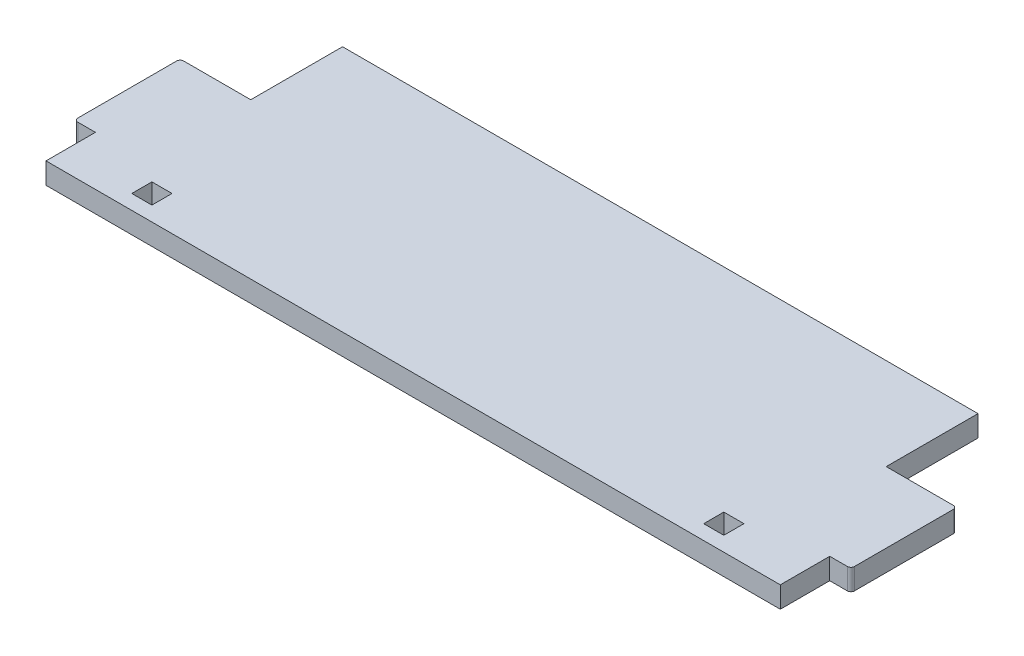
ISO-10303-21;
HEADER;
FILE_DESCRIPTION(('STEP AP214'),'2;1');
FILE_NAME('part.step','',(''),(''),'','','');
FILE_SCHEMA(('AUTOMOTIVE_DESIGN { 1 0 10303 214 1 1 1 1 }'));
ENDSEC;
DATA;
#1=APPLICATION_CONTEXT('core data for automotive mechanical design processes');
#2=APPLICATION_PROTOCOL_DEFINITION('international standard','automotive_design',2000,#1);
#3=PRODUCT_CONTEXT('',#1,'mechanical');
#4=PRODUCT('Part','Part','',(#3));
#5=PRODUCT_RELATED_PRODUCT_CATEGORY('part','',(#4));
#6=PRODUCT_DEFINITION_FORMATION('','',#4);
#7=PRODUCT_DEFINITION_CONTEXT('part definition',#1,'design');
#8=PRODUCT_DEFINITION('design','',#6,#7);
#9=PRODUCT_DEFINITION_SHAPE('','',#8);
#10=(LENGTH_UNIT() NAMED_UNIT(*) SI_UNIT(.MILLI.,.METRE.));
#11=(NAMED_UNIT(*) PLANE_ANGLE_UNIT() SI_UNIT($,.RADIAN.));
#12=(NAMED_UNIT(*) SI_UNIT($,.STERADIAN.) SOLID_ANGLE_UNIT());
#13=UNCERTAINTY_MEASURE_WITH_UNIT(LENGTH_MEASURE(1.E-05),#10,'distance_accuracy_value','');
#14=(GEOMETRIC_REPRESENTATION_CONTEXT(3) GLOBAL_UNCERTAINTY_ASSIGNED_CONTEXT((#13)) GLOBAL_UNIT_ASSIGNED_CONTEXT((#10,
#11,#12)) REPRESENTATION_CONTEXT('',''));
#15=CARTESIAN_POINT('',(0.,0.,0.));
#16=DIRECTION('',(0.,0.,1.));
#17=DIRECTION('',(1.,0.,0.));
#18=AXIS2_PLACEMENT_3D('',#15,#16,#17);
#19=CARTESIAN_POINT('',(0.,3.,-4.925));
#20=DIRECTION('',(0.,0.,-1.));
#21=DIRECTION('',(-1.,0.,0.));
#22=AXIS2_PLACEMENT_3D('',#19,#20,#21);
#23=PLANE('',#22);
#24=DIRECTION('',(1.,0.,0.));
#25=VECTOR('',#24,1.);
#26=CARTESIAN_POINT('',(0.,0.,-4.925));
#27=LINE('',#26,#25);
#28=CARTESIAN_POINT('',(39.075,0.,-4.925));
#29=VERTEX_POINT('',#28);
#30=CARTESIAN_POINT('',(41.925,0.,-4.925));
#31=VERTEX_POINT('',#30);
#32=EDGE_CURVE('E321',#29,#31,#27,.T.);
#33=ORIENTED_EDGE('',*,*,#32,.T.);
#34=DIRECTION('',(0.,-1.,0.));
#35=VECTOR('',#34,1.);
#36=CARTESIAN_POINT('',(41.925,3.,-4.925));
#37=LINE('',#36,#35);
#38=CARTESIAN_POINT('',(41.925,3.,-4.925));
#39=VERTEX_POINT('',#38);
#40=EDGE_CURVE('E336',#39,#31,#37,.T.);
#41=ORIENTED_EDGE('',*,*,#40,.F.);
#42=DIRECTION('',(1.,0.,0.));
#43=VECTOR('',#42,1.);
#44=CARTESIAN_POINT('',(0.,3.,-4.925));
#45=LINE('',#44,#43);
#46=CARTESIAN_POINT('',(39.075,3.,-4.925));
#47=VERTEX_POINT('',#46);
#48=EDGE_CURVE('E266',#47,#39,#45,.T.);
#49=ORIENTED_EDGE('',*,*,#48,.F.);
#50=DIRECTION('',(0.,-1.,0.));
#51=VECTOR('',#50,1.);
#52=CARTESIAN_POINT('',(39.075,3.,-4.925));
#53=LINE('',#52,#51);
#54=EDGE_CURVE('E329',#47,#29,#53,.T.);
#55=ORIENTED_EDGE('',*,*,#54,.T.);
#56=EDGE_LOOP('',(#33,#41,#49,#55));
#57=FACE_BOUND('',#56,.T.);
#58=ADVANCED_FACE('F40',(#57),#23,.F.);
#59=CARTESIAN_POINT('',(41.925,3.,0.));
#60=DIRECTION('',(1.,0.,0.));
#61=DIRECTION('',(0.,0.,-1.));
#62=AXIS2_PLACEMENT_3D('',#59,#60,#61);
#63=PLANE('',#62);
#64=DIRECTION('',(0.,0.,1.));
#65=VECTOR('',#64,1.);
#66=CARTESIAN_POINT('',(41.925,0.,0.));
#67=LINE('',#66,#65);
#68=CARTESIAN_POINT('',(41.925,0.,-2.075));
#69=VERTEX_POINT('',#68);
#70=EDGE_CURVE('E324',#31,#69,#67,.T.);
#71=ORIENTED_EDGE('',*,*,#70,.T.);
#72=DIRECTION('',(0.,-1.,0.));
#73=VECTOR('',#72,1.);
#74=CARTESIAN_POINT('',(41.925,3.,-2.075));
#75=LINE('',#74,#73);
#76=CARTESIAN_POINT('',(41.925,3.,-2.075));
#77=VERTEX_POINT('',#76);
#78=EDGE_CURVE('E334',#77,#69,#75,.T.);
#79=ORIENTED_EDGE('',*,*,#78,.F.);
#80=DIRECTION('',(0.,0.,1.));
#81=VECTOR('',#80,1.);
#82=CARTESIAN_POINT('',(41.925,3.,0.));
#83=LINE('',#82,#81);
#84=EDGE_CURVE('E269',#39,#77,#83,.T.);
#85=ORIENTED_EDGE('',*,*,#84,.F.);
#86=ORIENTED_EDGE('',*,*,#40,.T.);
#87=EDGE_LOOP('',(#71,#79,#85,#86));
#88=FACE_BOUND('',#87,.T.);
#89=ADVANCED_FACE('F464',(#88),#63,.F.);
#90=CARTESIAN_POINT('',(0.,3.,-2.075));
#91=DIRECTION('',(0.,0.,-1.));
#92=DIRECTION('',(-1.,0.,0.));
#93=AXIS2_PLACEMENT_3D('',#90,#91,#92);
#94=PLANE('',#93);
#95=DIRECTION('',(1.,0.,0.));
#96=VECTOR('',#95,1.);
#97=CARTESIAN_POINT('',(0.,0.,-2.075));
#98=LINE('',#97,#96);
#99=CARTESIAN_POINT('',(39.075,0.,-2.075));
#100=VERTEX_POINT('',#99);
#101=EDGE_CURVE('E230',#100,#69,#98,.T.);
#102=ORIENTED_EDGE('',*,*,#101,.F.);
#103=DIRECTION('',(0.,-1.,0.));
#104=VECTOR('',#103,1.);
#105=CARTESIAN_POINT('',(39.075,3.,-2.075));
#106=LINE('',#105,#104);
#107=CARTESIAN_POINT('',(39.075,3.,-2.075));
#108=VERTEX_POINT('',#107);
#109=EDGE_CURVE('E331',#108,#100,#106,.T.);
#110=ORIENTED_EDGE('',*,*,#109,.F.);
#111=DIRECTION('',(1.,0.,0.));
#112=VECTOR('',#111,1.);
#113=CARTESIAN_POINT('',(0.,3.,-2.075));
#114=LINE('',#113,#112);
#115=EDGE_CURVE('E271',#108,#77,#114,.T.);
#116=ORIENTED_EDGE('',*,*,#115,.T.);
#117=ORIENTED_EDGE('',*,*,#78,.T.);
#118=EDGE_LOOP('',(#102,#110,#116,#117));
#119=FACE_BOUND('',#118,.T.);
#120=ADVANCED_FACE('F470',(#119),#94,.T.);
#121=CARTESIAN_POINT('',(-52.,3.,0.));
#122=DIRECTION('',(-1.,0.,0.));
#123=DIRECTION('',(0.,0.,1.));
#124=AXIS2_PLACEMENT_3D('',#121,#122,#123);
#125=PLANE('',#124);
#126=DIRECTION('',(0.,0.,-1.));
#127=VECTOR('',#126,1.);
#128=CARTESIAN_POINT('',(-52.,0.,0.));
#129=LINE('',#128,#127);
#130=CARTESIAN_POINT('',(-52.,0.,0.));
#131=VERTEX_POINT('',#130);
#132=CARTESIAN_POINT('',(-52.,0.,-7.));
#133=VERTEX_POINT('',#132);
#134=EDGE_CURVE('E287',#131,#133,#129,.T.);
#135=ORIENTED_EDGE('',*,*,#134,.F.);
#136=DIRECTION('',(0.,-1.,0.));
#137=VECTOR('',#136,1.);
#138=CARTESIAN_POINT('',(-52.,3.,0.));
#139=LINE('',#138,#137);
#140=CARTESIAN_POINT('',(-52.,3.,0.));
#141=VERTEX_POINT('',#140);
#142=EDGE_CURVE('E332',#141,#131,#139,.T.);
#143=ORIENTED_EDGE('',*,*,#142,.F.);
#144=DIRECTION('',(0.,0.,-1.));
#145=VECTOR('',#144,1.);
#146=CARTESIAN_POINT('',(-52.,3.,0.));
#147=LINE('',#146,#145);
#148=CARTESIAN_POINT('',(-52.,3.,-7.));
#149=VERTEX_POINT('',#148);
#150=EDGE_CURVE('E235',#141,#149,#147,.T.);
#151=ORIENTED_EDGE('',*,*,#150,.T.);
#152=DIRECTION('',(0.,-1.,0.));
#153=VECTOR('',#152,1.);
#154=CARTESIAN_POINT('',(-52.,3.,-7.));
#155=LINE('',#154,#153);
#156=EDGE_CURVE('E213',#149,#133,#155,.T.);
#157=ORIENTED_EDGE('',*,*,#156,.T.);
#158=EDGE_LOOP('',(#135,#143,#151,#157));
#159=FACE_BOUND('',#158,.T.);
#160=ADVANCED_FACE('F418',(#159),#125,.T.);
#161=CARTESIAN_POINT('',(0.,3.,0.));
#162=DIRECTION('',(0.,0.,-1.));
#163=DIRECTION('',(-1.,0.,0.));
#164=AXIS2_PLACEMENT_3D('',#161,#162,#163);
#165=PLANE('',#164);
#166=DIRECTION('',(1.,0.,0.));
#167=VECTOR('',#166,1.);
#168=CARTESIAN_POINT('',(0.,0.,0.));
#169=LINE('',#168,#167);
#170=CARTESIAN_POINT('',(52.,0.,0.));
#171=VERTEX_POINT('',#170);
#172=EDGE_CURVE('E290',#131,#171,#169,.T.);
#173=ORIENTED_EDGE('',*,*,#172,.T.);
#174=DIRECTION('',(0.,-1.,0.));
#175=VECTOR('',#174,1.);
#176=CARTESIAN_POINT('',(52.,3.,0.));
#177=LINE('',#176,#175);
#178=CARTESIAN_POINT('',(52.,3.,0.));
#179=VERTEX_POINT('',#178);
#180=EDGE_CURVE('E355',#179,#171,#177,.T.);
#181=ORIENTED_EDGE('',*,*,#180,.F.);
#182=DIRECTION('',(1.,0.,0.));
#183=VECTOR('',#182,1.);
#184=CARTESIAN_POINT('',(0.,3.,0.));
#185=LINE('',#184,#183);
#186=EDGE_CURVE('E238',#141,#179,#185,.T.);
#187=ORIENTED_EDGE('',*,*,#186,.F.);
#188=ORIENTED_EDGE('',*,*,#142,.T.);
#189=EDGE_LOOP('',(#173,#181,#187,#188));
#190=FACE_BOUND('',#189,.T.);
#191=ADVANCED_FACE('F421',(#190),#165,.F.);
#192=CARTESIAN_POINT('',(52.,3.,0.));
#193=DIRECTION('',(-1.,0.,0.));
#194=DIRECTION('',(0.,0.,1.));
#195=AXIS2_PLACEMENT_3D('',#192,#193,#194);
#196=PLANE('',#195);
#197=DIRECTION('',(0.,0.,-1.));
#198=VECTOR('',#197,1.);
#199=CARTESIAN_POINT('',(52.,0.,0.));
#200=LINE('',#199,#198);
#201=CARTESIAN_POINT('',(52.,0.,-7.));
#202=VERTEX_POINT('',#201);
#203=EDGE_CURVE('E293',#171,#202,#200,.T.);
#204=ORIENTED_EDGE('',*,*,#203,.T.);
#205=DIRECTION('',(0.,-1.,0.));
#206=VECTOR('',#205,1.);
#207=CARTESIAN_POINT('',(52.,3.,-7.));
#208=LINE('',#207,#206);
#209=CARTESIAN_POINT('',(52.,3.,-7.));
#210=VERTEX_POINT('',#209);
#211=EDGE_CURVE('E352',#210,#202,#208,.T.);
#212=ORIENTED_EDGE('',*,*,#211,.F.);
#213=DIRECTION('',(0.,0.,-1.));
#214=VECTOR('',#213,1.);
#215=CARTESIAN_POINT('',(52.,3.,0.));
#216=LINE('',#215,#214);
#217=EDGE_CURVE('E241',#179,#210,#216,.T.);
#218=ORIENTED_EDGE('',*,*,#217,.F.);
#219=ORIENTED_EDGE('',*,*,#180,.T.);
#220=EDGE_LOOP('',(#204,#212,#218,#219));
#221=FACE_BOUND('',#220,.T.);
#222=ADVANCED_FACE('F423',(#221),#196,.F.);
#223=CARTESIAN_POINT('',(0.,3.,-7.00000000000002));
#224=DIRECTION('',(0.,0.,-1.));
#225=DIRECTION('',(-1.,0.,0.));
#226=AXIS2_PLACEMENT_3D('',#223,#224,#225);
#227=PLANE('',#226);
#228=DIRECTION('',(1.,0.,0.));
#229=VECTOR('',#228,1.);
#230=CARTESIAN_POINT('',(0.,0.,-7.00000000000002));
#231=LINE('',#230,#229);
#232=CARTESIAN_POINT('',(54.5,0.,-7.));
#233=VERTEX_POINT('',#232);
#234=EDGE_CURVE('E296',#202,#233,#231,.T.);
#235=ORIENTED_EDGE('',*,*,#234,.T.);
#236=DIRECTION('',(0.,-1.,0.));
#237=VECTOR('',#236,1.);
#238=CARTESIAN_POINT('',(54.5,3.,-7.));
#239=LINE('',#238,#237);
#240=CARTESIAN_POINT('',(54.5,3.,-7.));
#241=VERTEX_POINT('',#240);
#242=EDGE_CURVE('E384',#233,#241,#239,.F.);
#243=ORIENTED_EDGE('',*,*,#242,.T.);
#244=DIRECTION('',(1.,0.,0.));
#245=VECTOR('',#244,1.);
#246=CARTESIAN_POINT('',(0.,3.,-7.00000000000002));
#247=LINE('',#246,#245);
#248=EDGE_CURVE('E244',#210,#241,#247,.T.);
#249=ORIENTED_EDGE('',*,*,#248,.F.);
#250=ORIENTED_EDGE('',*,*,#211,.T.);
#251=EDGE_LOOP('',(#235,#243,#249,#250));
#252=FACE_BOUND('',#251,.T.);
#253=ADVANCED_FACE('F576',(#252),#227,.F.);
#254=CARTESIAN_POINT('',(55.,3.,0.));
#255=DIRECTION('',(-1.,0.,0.));
#256=DIRECTION('',(0.,0.,1.));
#257=AXIS2_PLACEMENT_3D('',#254,#255,#256);
#258=PLANE('',#257);
#259=DIRECTION('',(0.,0.,-1.));
#260=VECTOR('',#259,1.);
#261=CARTESIAN_POINT('',(55.,0.,0.));
#262=LINE('',#261,#260);
#263=CARTESIAN_POINT('',(55.,0.,-7.5));
#264=VERTEX_POINT('',#263);
#265=CARTESIAN_POINT('',(55.,0.,-21.5));
#266=VERTEX_POINT('',#265);
#267=EDGE_CURVE('E299',#264,#266,#262,.T.);
#268=ORIENTED_EDGE('',*,*,#267,.T.);
#269=DIRECTION('',(0.,-1.,0.));
#270=VECTOR('',#269,1.);
#271=CARTESIAN_POINT('',(55.,3.,-21.5));
#272=LINE('',#271,#270);
#273=CARTESIAN_POINT('',(55.,3.,-21.5));
#274=VERTEX_POINT('',#273);
#275=EDGE_CURVE('E376',#266,#274,#272,.F.);
#276=ORIENTED_EDGE('',*,*,#275,.T.);
#277=DIRECTION('',(0.,0.,-1.));
#278=VECTOR('',#277,1.);
#279=CARTESIAN_POINT('',(55.,3.,0.));
#280=LINE('',#279,#278);
#281=CARTESIAN_POINT('',(55.,3.,-7.5));
#282=VERTEX_POINT('',#281);
#283=EDGE_CURVE('E247',#282,#274,#280,.T.);
#284=ORIENTED_EDGE('',*,*,#283,.F.);
#285=DIRECTION('',(0.,-1.,0.));
#286=VECTOR('',#285,1.);
#287=CARTESIAN_POINT('',(55.,3.,-7.5));
#288=LINE('',#287,#286);
#289=EDGE_CURVE('E373',#282,#264,#288,.T.);
#290=ORIENTED_EDGE('',*,*,#289,.T.);
#291=EDGE_LOOP('',(#268,#276,#284,#290));
#292=FACE_BOUND('',#291,.T.);
#293=ADVANCED_FACE('F434',(#292),#258,.F.);
#294=CARTESIAN_POINT('',(0.,3.,-22.));
#295=DIRECTION('',(0.,0.,1.));
#296=DIRECTION('',(1.,0.,0.));
#297=AXIS2_PLACEMENT_3D('',#294,#295,#296);
#298=PLANE('',#297);
#299=DIRECTION('',(-1.,0.,0.));
#300=VECTOR('',#299,1.);
#301=CARTESIAN_POINT('',(0.,3.,-22.));
#302=LINE('',#301,#300);
#303=CARTESIAN_POINT('',(54.5,3.,-22.));
#304=VERTEX_POINT('',#303);
#305=CARTESIAN_POINT('',(45.,3.,-22.));
#306=VERTEX_POINT('',#305);
#307=EDGE_CURVE('E250',#304,#306,#302,.T.);
#308=ORIENTED_EDGE('',*,*,#307,.F.);
#309=DIRECTION('',(0.,-1.,0.));
#310=VECTOR('',#309,1.);
#311=CARTESIAN_POINT('',(54.5,3.,-22.));
#312=LINE('',#311,#310);
#313=CARTESIAN_POINT('',(54.5,0.,-22.));
#314=VERTEX_POINT('',#313);
#315=EDGE_CURVE('E339',#304,#314,#312,.T.);
#316=ORIENTED_EDGE('',*,*,#315,.T.);
#317=DIRECTION('',(-1.,0.,0.));
#318=VECTOR('',#317,1.);
#319=CARTESIAN_POINT('',(0.,0.,-22.));
#320=LINE('',#319,#318);
#321=CARTESIAN_POINT('',(45.,0.,-22.));
#322=VERTEX_POINT('',#321);
#323=EDGE_CURVE('E302',#314,#322,#320,.T.);
#324=ORIENTED_EDGE('',*,*,#323,.T.);
#325=DIRECTION('',(0.,-1.,0.));
#326=VECTOR('',#325,1.);
#327=CARTESIAN_POINT('',(45.,3.,-22.));
#328=LINE('',#327,#326);
#329=EDGE_CURVE('E349',#306,#322,#328,.T.);
#330=ORIENTED_EDGE('',*,*,#329,.F.);
#331=EDGE_LOOP('',(#308,#316,#324,#330));
#332=FACE_BOUND('',#331,.T.);
#333=ADVANCED_FACE('F443',(#332),#298,.F.);
#334=CARTESIAN_POINT('',(45.,3.,0.));
#335=DIRECTION('',(-1.,0.,0.));
#336=DIRECTION('',(0.,0.,1.));
#337=AXIS2_PLACEMENT_3D('',#334,#335,#336);
#338=PLANE('',#337);
#339=DIRECTION('',(0.,0.,-1.));
#340=VECTOR('',#339,1.);
#341=CARTESIAN_POINT('',(45.,0.,0.));
#342=LINE('',#341,#340);
#343=CARTESIAN_POINT('',(45.,0.,-35.));
#344=VERTEX_POINT('',#343);
#345=EDGE_CURVE('E304',#322,#344,#342,.T.);
#346=ORIENTED_EDGE('',*,*,#345,.T.);
#347=DIRECTION('',(0.,-1.,0.));
#348=VECTOR('',#347,1.);
#349=CARTESIAN_POINT('',(45.,3.,-35.));
#350=LINE('',#349,#348);
#351=CARTESIAN_POINT('',(45.,3.,-35.));
#352=VERTEX_POINT('',#351);
#353=EDGE_CURVE('E346',#352,#344,#350,.T.);
#354=ORIENTED_EDGE('',*,*,#353,.F.);
#355=DIRECTION('',(0.,0.,-1.));
#356=VECTOR('',#355,1.);
#357=CARTESIAN_POINT('',(45.,3.,0.));
#358=LINE('',#357,#356);
#359=EDGE_CURVE('E252',#306,#352,#358,.T.);
#360=ORIENTED_EDGE('',*,*,#359,.F.);
#361=ORIENTED_EDGE('',*,*,#329,.T.);
#362=EDGE_LOOP('',(#346,#354,#360,#361));
#363=FACE_BOUND('',#362,.T.);
#364=ADVANCED_FACE('F448',(#363),#338,.F.);
#365=CARTESIAN_POINT('',(0.,3.,-35.));
#366=DIRECTION('',(0.,0.,1.));
#367=DIRECTION('',(1.,0.,0.));
#368=AXIS2_PLACEMENT_3D('',#365,#366,#367);
#369=PLANE('',#368);
#370=DIRECTION('',(-1.,0.,0.));
#371=VECTOR('',#370,1.);
#372=CARTESIAN_POINT('',(0.,0.,-35.));
#373=LINE('',#372,#371);
#374=CARTESIAN_POINT('',(-45.,0.,-35.));
#375=VERTEX_POINT('',#374);
#376=EDGE_CURVE('E307',#344,#375,#373,.T.);
#377=ORIENTED_EDGE('',*,*,#376,.T.);
#378=DIRECTION('',(0.,-1.,0.));
#379=VECTOR('',#378,1.);
#380=CARTESIAN_POINT('',(-45.,3.,-35.));
#381=LINE('',#380,#379);
#382=CARTESIAN_POINT('',(-45.,3.,-35.));
#383=VERTEX_POINT('',#382);
#384=EDGE_CURVE('E344',#383,#375,#381,.T.);
#385=ORIENTED_EDGE('',*,*,#384,.F.);
#386=DIRECTION('',(-1.,0.,0.));
#387=VECTOR('',#386,1.);
#388=CARTESIAN_POINT('',(0.,3.,-35.));
#389=LINE('',#388,#387);
#390=EDGE_CURVE('E255',#352,#383,#389,.T.);
#391=ORIENTED_EDGE('',*,*,#390,.F.);
#392=ORIENTED_EDGE('',*,*,#353,.T.);
#393=EDGE_LOOP('',(#377,#385,#391,#392));
#394=FACE_BOUND('',#393,.T.);
#395=ADVANCED_FACE('F450',(#394),#369,.F.);
#396=CARTESIAN_POINT('',(-45.,3.,0.));
#397=DIRECTION('',(-1.,0.,0.));
#398=DIRECTION('',(0.,0.,1.));
#399=AXIS2_PLACEMENT_3D('',#396,#397,#398);
#400=PLANE('',#399);
#401=DIRECTION('',(0.,0.,-1.));
#402=VECTOR('',#401,1.);
#403=CARTESIAN_POINT('',(-45.,0.,0.));
#404=LINE('',#403,#402);
#405=CARTESIAN_POINT('',(-45.,0.,-22.));
#406=VERTEX_POINT('',#405);
#407=EDGE_CURVE('E310',#406,#375,#404,.T.);
#408=ORIENTED_EDGE('',*,*,#407,.F.);
#409=DIRECTION('',(0.,-1.,0.));
#410=VECTOR('',#409,1.);
#411=CARTESIAN_POINT('',(-45.,3.,-22.));
#412=LINE('',#411,#410);
#413=CARTESIAN_POINT('',(-45.,3.,-22.));
#414=VERTEX_POINT('',#413);
#415=EDGE_CURVE('E341',#414,#406,#412,.T.);
#416=ORIENTED_EDGE('',*,*,#415,.F.);
#417=DIRECTION('',(0.,0.,-1.));
#418=VECTOR('',#417,1.);
#419=CARTESIAN_POINT('',(-45.,3.,0.));
#420=LINE('',#419,#418);
#421=EDGE_CURVE('E257',#414,#383,#420,.T.);
#422=ORIENTED_EDGE('',*,*,#421,.T.);
#423=ORIENTED_EDGE('',*,*,#384,.T.);
#424=EDGE_LOOP('',(#408,#416,#422,#423));
#425=FACE_BOUND('',#424,.T.);
#426=ADVANCED_FACE('F454',(#425),#400,.T.);
#427=CARTESIAN_POINT('',(0.,3.,-22.));
#428=DIRECTION('',(0.,0.,-1.));
#429=DIRECTION('',(-1.,0.,0.));
#430=AXIS2_PLACEMENT_3D('',#427,#428,#429);
#431=PLANE('',#430);
#432=DIRECTION('',(1.,0.,0.));
#433=VECTOR('',#432,1.);
#434=CARTESIAN_POINT('',(0.,0.,-22.));
#435=LINE('',#434,#433);
#436=CARTESIAN_POINT('',(-54.5,0.,-22.));
#437=VERTEX_POINT('',#436);
#438=EDGE_CURVE('E313',#437,#406,#435,.T.);
#439=ORIENTED_EDGE('',*,*,#438,.F.);
#440=DIRECTION('',(0.,-1.,0.));
#441=VECTOR('',#440,1.);
#442=CARTESIAN_POINT('',(-54.5,3.,-22.));
#443=LINE('',#442,#441);
#444=CARTESIAN_POINT('',(-54.5,3.,-22.));
#445=VERTEX_POINT('',#444);
#446=EDGE_CURVE('E48',#437,#445,#443,.F.);
#447=ORIENTED_EDGE('',*,*,#446,.T.);
#448=DIRECTION('',(1.,0.,0.));
#449=VECTOR('',#448,1.);
#450=CARTESIAN_POINT('',(0.,3.,-22.));
#451=LINE('',#450,#449);
#452=EDGE_CURVE('E260',#445,#414,#451,.T.);
#453=ORIENTED_EDGE('',*,*,#452,.T.);
#454=ORIENTED_EDGE('',*,*,#415,.T.);
#455=EDGE_LOOP('',(#439,#447,#453,#454));
#456=FACE_BOUND('',#455,.T.);
#457=ADVANCED_FACE('F393',(#456),#431,.T.);
#458=CARTESIAN_POINT('',(-55.,3.,0.));
#459=DIRECTION('',(-1.,0.,0.));
#460=DIRECTION('',(0.,0.,1.));
#461=AXIS2_PLACEMENT_3D('',#458,#459,#460);
#462=PLANE('',#461);
#463=DIRECTION('',(0.,0.,-1.));
#464=VECTOR('',#463,1.);
#465=CARTESIAN_POINT('',(-55.,3.,0.));
#466=LINE('',#465,#464);
#467=CARTESIAN_POINT('',(-55.,3.,-7.5));
#468=VERTEX_POINT('',#467);
#469=CARTESIAN_POINT('',(-55.,3.,-21.5));
#470=VERTEX_POINT('',#469);
#471=EDGE_CURVE('E262',#468,#470,#466,.T.);
#472=ORIENTED_EDGE('',*,*,#471,.T.);
#473=DIRECTION('',(0.,-1.,0.));
#474=VECTOR('',#473,1.);
#475=CARTESIAN_POINT('',(-55.,3.,-21.5));
#476=LINE('',#475,#474);
#477=CARTESIAN_POINT('',(-55.,0.,-21.5));
#478=VERTEX_POINT('',#477);
#479=EDGE_CURVE('E388',#470,#478,#476,.T.);
#480=ORIENTED_EDGE('',*,*,#479,.T.);
#481=DIRECTION('',(0.,0.,-1.));
#482=VECTOR('',#481,1.);
#483=CARTESIAN_POINT('',(-55.,0.,0.));
#484=LINE('',#483,#482);
#485=CARTESIAN_POINT('',(-55.,0.,-7.5));
#486=VERTEX_POINT('',#485);
#487=EDGE_CURVE('E315',#486,#478,#484,.T.);
#488=ORIENTED_EDGE('',*,*,#487,.F.);
#489=DIRECTION('',(0.,-1.,0.));
#490=VECTOR('',#489,1.);
#491=CARTESIAN_POINT('',(-55.,3.,-7.5));
#492=LINE('',#491,#490);
#493=EDGE_CURVE('E386',#486,#468,#492,.F.);
#494=ORIENTED_EDGE('',*,*,#493,.T.);
#495=EDGE_LOOP('',(#472,#480,#488,#494));
#496=FACE_BOUND('',#495,.T.);
#497=ADVANCED_FACE('F402',(#496),#462,.T.);
#498=CARTESIAN_POINT('',(0.,3.,-4.925));
#499=DIRECTION('',(0.,0.,1.));
#500=DIRECTION('',(1.,0.,0.));
#501=AXIS2_PLACEMENT_3D('',#498,#499,#500);
#502=PLANE('',#501);
#503=DIRECTION('',(-1.,0.,0.));
#504=VECTOR('',#503,1.);
#505=CARTESIAN_POINT('',(0.,0.,-4.925));
#506=LINE('',#505,#504);
#507=CARTESIAN_POINT('',(-39.075,0.,-4.925));
#508=VERTEX_POINT('',#507);
#509=CARTESIAN_POINT('',(-41.925,0.,-4.925));
#510=VERTEX_POINT('',#509);
#511=EDGE_CURVE('E210',#508,#510,#506,.T.);
#512=ORIENTED_EDGE('',*,*,#511,.F.);
#513=DIRECTION('',(0.,-1.,0.));
#514=VECTOR('',#513,1.);
#515=CARTESIAN_POINT('',(-39.075,3.,-4.925));
#516=LINE('',#515,#514);
#517=CARTESIAN_POINT('',(-39.075,3.,-4.925));
#518=VERTEX_POINT('',#517);
#519=EDGE_CURVE('E203',#518,#508,#516,.T.);
#520=ORIENTED_EDGE('',*,*,#519,.F.);
#521=DIRECTION('',(-1.,0.,0.));
#522=VECTOR('',#521,1.);
#523=CARTESIAN_POINT('',(0.,3.,-4.925));
#524=LINE('',#523,#522);
#525=CARTESIAN_POINT('',(-41.925,3.,-4.925));
#526=VERTEX_POINT('',#525);
#527=EDGE_CURVE('E207',#518,#526,#524,.T.);
#528=ORIENTED_EDGE('',*,*,#527,.T.);
#529=DIRECTION('',(0.,-1.,0.));
#530=VECTOR('',#529,1.);
#531=CARTESIAN_POINT('',(-41.925,3.,-4.925));
#532=LINE('',#531,#530);
#533=EDGE_CURVE('E277',#526,#510,#532,.T.);
#534=ORIENTED_EDGE('',*,*,#533,.T.);
#535=EDGE_LOOP('',(#512,#520,#528,#534));
#536=FACE_BOUND('',#535,.T.);
#537=ADVANCED_FACE('F205',(#536),#502,.T.);
#538=CARTESIAN_POINT('',(-39.075,3.,0.));
#539=DIRECTION('',(1.,0.,0.));
#540=DIRECTION('',(0.,0.,-1.));
#541=AXIS2_PLACEMENT_3D('',#538,#539,#540);
#542=PLANE('',#541);
#543=DIRECTION('',(0.,0.,1.));
#544=VECTOR('',#543,1.);
#545=CARTESIAN_POINT('',(-39.075,0.,0.));
#546=LINE('',#545,#544);
#547=CARTESIAN_POINT('',(-39.075,0.,-2.075));
#548=VERTEX_POINT('',#547);
#549=EDGE_CURVE('E279',#508,#548,#546,.T.);
#550=ORIENTED_EDGE('',*,*,#549,.T.);
#551=DIRECTION('',(0.,-1.,0.));
#552=VECTOR('',#551,1.);
#553=CARTESIAN_POINT('',(-39.075,3.,-2.075));
#554=LINE('',#553,#552);
#555=CARTESIAN_POINT('',(-39.075,3.,-2.075));
#556=VERTEX_POINT('',#555);
#557=EDGE_CURVE('E214',#556,#548,#554,.T.);
#558=ORIENTED_EDGE('',*,*,#557,.F.);
#559=DIRECTION('',(0.,0.,1.));
#560=VECTOR('',#559,1.);
#561=CARTESIAN_POINT('',(-39.075,3.,0.));
#562=LINE('',#561,#560);
#563=EDGE_CURVE('E217',#518,#556,#562,.T.);
#564=ORIENTED_EDGE('',*,*,#563,.F.);
#565=ORIENTED_EDGE('',*,*,#519,.T.);
#566=EDGE_LOOP('',(#550,#558,#564,#565));
#567=FACE_BOUND('',#566,.T.);
#568=ADVANCED_FACE('F218',(#567),#542,.F.);
#569=CARTESIAN_POINT('',(0.,3.,-2.075));
#570=DIRECTION('',(0.,0.,1.));
#571=DIRECTION('',(1.,0.,0.));
#572=AXIS2_PLACEMENT_3D('',#569,#570,#571);
#573=PLANE('',#572);
#574=DIRECTION('',(-1.,0.,0.));
#575=VECTOR('',#574,1.);
#576=CARTESIAN_POINT('',(0.,0.,-2.075));
#577=LINE('',#576,#575);
#578=CARTESIAN_POINT('',(-41.925,0.,-2.075));
#579=VERTEX_POINT('',#578);
#580=EDGE_CURVE('E281',#548,#579,#577,.T.);
#581=ORIENTED_EDGE('',*,*,#580,.T.);
#582=DIRECTION('',(0.,-1.,0.));
#583=VECTOR('',#582,1.);
#584=CARTESIAN_POINT('',(-41.925,3.,-2.075));
#585=LINE('',#584,#583);
#586=CARTESIAN_POINT('',(-41.925,3.,-2.075));
#587=VERTEX_POINT('',#586);
#588=EDGE_CURVE('E360',#587,#579,#585,.T.);
#589=ORIENTED_EDGE('',*,*,#588,.F.);
#590=DIRECTION('',(-1.,0.,0.));
#591=VECTOR('',#590,1.);
#592=CARTESIAN_POINT('',(0.,3.,-2.075));
#593=LINE('',#592,#591);
#594=EDGE_CURVE('E222',#556,#587,#593,.T.);
#595=ORIENTED_EDGE('',*,*,#594,.F.);
#596=ORIENTED_EDGE('',*,*,#557,.T.);
#597=EDGE_LOOP('',(#581,#589,#595,#596));
#598=FACE_BOUND('',#597,.T.);
#599=ADVANCED_FACE('F478',(#598),#573,.F.);
#600=CARTESIAN_POINT('',(0.,3.,-7.00000000000002));
#601=DIRECTION('',(0.,0.,1.));
#602=DIRECTION('',(1.,0.,0.));
#603=AXIS2_PLACEMENT_3D('',#600,#601,#602);
#604=PLANE('',#603);
#605=DIRECTION('',(-1.,0.,0.));
#606=VECTOR('',#605,1.);
#607=CARTESIAN_POINT('',(0.,3.,-7.00000000000002));
#608=LINE('',#607,#606);
#609=CARTESIAN_POINT('',(-54.5,3.,-7.));
#610=VERTEX_POINT('',#609);
#611=EDGE_CURVE('E264',#149,#610,#608,.T.);
#612=ORIENTED_EDGE('',*,*,#611,.T.);
#613=DIRECTION('',(0.,-1.,0.));
#614=VECTOR('',#613,1.);
#615=CARTESIAN_POINT('',(-54.5,3.,-7.));
#616=LINE('',#615,#614);
#617=CARTESIAN_POINT('',(-54.5,0.,-7.));
#618=VERTEX_POINT('',#617);
#619=EDGE_CURVE('E11',#610,#618,#616,.T.);
#620=ORIENTED_EDGE('',*,*,#619,.T.);
#621=DIRECTION('',(-1.,0.,0.));
#622=VECTOR('',#621,1.);
#623=CARTESIAN_POINT('',(0.,0.,-7.00000000000002));
#624=LINE('',#623,#622);
#625=EDGE_CURVE('E318',#133,#618,#624,.T.);
#626=ORIENTED_EDGE('',*,*,#625,.F.);
#627=ORIENTED_EDGE('',*,*,#156,.F.);
#628=EDGE_LOOP('',(#612,#620,#626,#627));
#629=FACE_BOUND('',#628,.T.);
#630=ADVANCED_FACE('F412',(#629),#604,.T.);
#631=CARTESIAN_POINT('',(-41.925,3.,0.));
#632=DIRECTION('',(1.,0.,0.));
#633=DIRECTION('',(0.,0.,-1.));
#634=AXIS2_PLACEMENT_3D('',#631,#632,#633);
#635=PLANE('',#634);
#636=DIRECTION('',(0.,0.,1.));
#637=VECTOR('',#636,1.);
#638=CARTESIAN_POINT('',(-41.925,0.,0.));
#639=LINE('',#638,#637);
#640=EDGE_CURVE('E284',#510,#579,#639,.T.);
#641=ORIENTED_EDGE('',*,*,#640,.F.);
#642=ORIENTED_EDGE('',*,*,#533,.F.);
#643=DIRECTION('',(0.,0.,1.));
#644=VECTOR('',#643,1.);
#645=CARTESIAN_POINT('',(-41.925,3.,0.));
#646=LINE('',#645,#644);
#647=EDGE_CURVE('E226',#526,#587,#646,.T.);
#648=ORIENTED_EDGE('',*,*,#647,.T.);
#649=ORIENTED_EDGE('',*,*,#588,.T.);
#650=EDGE_LOOP('',(#641,#642,#648,#649));
#651=FACE_BOUND('',#650,.T.);
#652=ADVANCED_FACE('F477',(#651),#635,.T.);
#653=CARTESIAN_POINT('',(39.075,3.,0.));
#654=DIRECTION('',(1.,0.,0.));
#655=DIRECTION('',(0.,0.,-1.));
#656=AXIS2_PLACEMENT_3D('',#653,#654,#655);
#657=PLANE('',#656);
#658=DIRECTION('',(0.,0.,1.));
#659=VECTOR('',#658,1.);
#660=CARTESIAN_POINT('',(39.075,0.,0.));
#661=LINE('',#660,#659);
#662=EDGE_CURVE('E227',#29,#100,#661,.T.);
#663=ORIENTED_EDGE('',*,*,#662,.F.);
#664=ORIENTED_EDGE('',*,*,#54,.F.);
#665=DIRECTION('',(0.,0.,1.));
#666=VECTOR('',#665,1.);
#667=CARTESIAN_POINT('',(39.075,3.,0.));
#668=LINE('',#667,#666);
#669=EDGE_CURVE('E274',#47,#108,#668,.T.);
#670=ORIENTED_EDGE('',*,*,#669,.T.);
#671=ORIENTED_EDGE('',*,*,#109,.T.);
#672=EDGE_LOOP('',(#663,#664,#670,#671));
#673=FACE_BOUND('',#672,.T.);
#674=ADVANCED_FACE('F533',(#673),#657,.T.);
#675=CARTESIAN_POINT('',(0.,3.,0.));
#676=DIRECTION('',(0.,1.,0.));
#677=DIRECTION('',(0.,0.,1.));
#678=AXIS2_PLACEMENT_3D('',#675,#676,#677);
#679=PLANE('',#678);
#680=ORIENTED_EDGE('',*,*,#527,.F.);
#681=ORIENTED_EDGE('',*,*,#563,.T.);
#682=ORIENTED_EDGE('',*,*,#594,.T.);
#683=ORIENTED_EDGE('',*,*,#647,.F.);
#684=EDGE_LOOP('',(#680,#681,#682,#683));
#685=FACE_BOUND('',#684,.T.);
#686=ORIENTED_EDGE('',*,*,#283,.T.);
#687=CARTESIAN_POINT('',(54.5,3.,-21.5));
#688=DIRECTION('',(0.,1.,0.));
#689=DIRECTION('',(0.,0.,1.));
#690=AXIS2_PLACEMENT_3D('',#687,#688,#689);
#691=CIRCLE('',#690,0.5);
#692=EDGE_CURVE('E382',#274,#304,#691,.T.);
#693=ORIENTED_EDGE('',*,*,#692,.T.);
#694=ORIENTED_EDGE('',*,*,#307,.T.);
#695=ORIENTED_EDGE('',*,*,#359,.T.);
#696=ORIENTED_EDGE('',*,*,#390,.T.);
#697=ORIENTED_EDGE('',*,*,#421,.F.);
#698=ORIENTED_EDGE('',*,*,#452,.F.);
#699=CARTESIAN_POINT('',(-54.5,3.,-21.5));
#700=DIRECTION('',(0.,1.,0.));
#701=DIRECTION('',(0.,0.,1.));
#702=AXIS2_PLACEMENT_3D('',#699,#700,#701);
#703=CIRCLE('',#702,0.5);
#704=EDGE_CURVE('E61',#445,#470,#703,.T.);
#705=ORIENTED_EDGE('',*,*,#704,.T.);
#706=ORIENTED_EDGE('',*,*,#471,.F.);
#707=CARTESIAN_POINT('',(-54.5,3.,-7.5));
#708=DIRECTION('',(0.,1.,0.));
#709=DIRECTION('',(0.,0.,1.));
#710=AXIS2_PLACEMENT_3D('',#707,#708,#709);
#711=CIRCLE('',#710,0.5);
#712=EDGE_CURVE('E55',#468,#610,#711,.T.);
#713=ORIENTED_EDGE('',*,*,#712,.T.);
#714=ORIENTED_EDGE('',*,*,#611,.F.);
#715=ORIENTED_EDGE('',*,*,#150,.F.);
#716=ORIENTED_EDGE('',*,*,#186,.T.);
#717=ORIENTED_EDGE('',*,*,#217,.T.);
#718=ORIENTED_EDGE('',*,*,#248,.T.);
#719=CARTESIAN_POINT('',(54.5,3.,-7.5));
#720=DIRECTION('',(0.,1.,0.));
#721=DIRECTION('',(0.,0.,1.));
#722=AXIS2_PLACEMENT_3D('',#719,#720,#721);
#723=CIRCLE('',#722,0.5);
#724=EDGE_CURVE('E380',#241,#282,#723,.T.);
#725=ORIENTED_EDGE('',*,*,#724,.T.);
#726=EDGE_LOOP('',(#686,#693,#694,#695,#696,#697,#698,#705,#706,#713,#714,#715,#716,#717,#718,#725));
#727=FACE_BOUND('',#726,.T.);
#728=ORIENTED_EDGE('',*,*,#48,.T.);
#729=ORIENTED_EDGE('',*,*,#84,.T.);
#730=ORIENTED_EDGE('',*,*,#115,.F.);
#731=ORIENTED_EDGE('',*,*,#669,.F.);
#732=EDGE_LOOP('',(#728,#729,#730,#731));
#733=FACE_BOUND('',#732,.T.);
#734=ADVANCED_FACE('F224',(#685,#727,#733),#679,.T.);
#735=CARTESIAN_POINT('',(0.,0.,0.));
#736=DIRECTION('',(0.,1.,0.));
#737=DIRECTION('',(0.,0.,1.));
#738=AXIS2_PLACEMENT_3D('',#735,#736,#737);
#739=PLANE('',#738);
#740=ORIENTED_EDGE('',*,*,#511,.T.);
#741=ORIENTED_EDGE('',*,*,#640,.T.);
#742=ORIENTED_EDGE('',*,*,#580,.F.);
#743=ORIENTED_EDGE('',*,*,#549,.F.);
#744=EDGE_LOOP('',(#740,#741,#742,#743));
#745=FACE_BOUND('',#744,.T.);
#746=ORIENTED_EDGE('',*,*,#323,.F.);
#747=CARTESIAN_POINT('',(54.5,0.,-21.5));
#748=DIRECTION('',(0.,1.,0.));
#749=DIRECTION('',(0.,0.,1.));
#750=AXIS2_PLACEMENT_3D('',#747,#748,#749);
#751=CIRCLE('',#750,0.5);
#752=EDGE_CURVE('E371',#314,#266,#751,.F.);
#753=ORIENTED_EDGE('',*,*,#752,.T.);
#754=ORIENTED_EDGE('',*,*,#267,.F.);
#755=CARTESIAN_POINT('',(54.5,0.,-7.5));
#756=DIRECTION('',(0.,1.,0.));
#757=DIRECTION('',(0.,0.,1.));
#758=AXIS2_PLACEMENT_3D('',#755,#756,#757);
#759=CIRCLE('',#758,0.5);
#760=EDGE_CURVE('E369',#264,#233,#759,.F.);
#761=ORIENTED_EDGE('',*,*,#760,.T.);
#762=ORIENTED_EDGE('',*,*,#234,.F.);
#763=ORIENTED_EDGE('',*,*,#203,.F.);
#764=ORIENTED_EDGE('',*,*,#172,.F.);
#765=ORIENTED_EDGE('',*,*,#134,.T.);
#766=ORIENTED_EDGE('',*,*,#625,.T.);
#767=CARTESIAN_POINT('',(-54.5,0.,-7.5));
#768=DIRECTION('',(0.,1.,0.));
#769=DIRECTION('',(0.,0.,1.));
#770=AXIS2_PLACEMENT_3D('',#767,#768,#769);
#771=CIRCLE('',#770,0.5);
#772=EDGE_CURVE('E365',#618,#486,#771,.F.);
#773=ORIENTED_EDGE('',*,*,#772,.T.);
#774=ORIENTED_EDGE('',*,*,#487,.T.);
#775=CARTESIAN_POINT('',(-54.5,0.,-21.5));
#776=DIRECTION('',(0.,1.,0.));
#777=DIRECTION('',(0.,0.,1.));
#778=AXIS2_PLACEMENT_3D('',#775,#776,#777);
#779=CIRCLE('',#778,0.5);
#780=EDGE_CURVE('E367',#478,#437,#779,.F.);
#781=ORIENTED_EDGE('',*,*,#780,.T.);
#782=ORIENTED_EDGE('',*,*,#438,.T.);
#783=ORIENTED_EDGE('',*,*,#407,.T.);
#784=ORIENTED_EDGE('',*,*,#376,.F.);
#785=ORIENTED_EDGE('',*,*,#345,.F.);
#786=EDGE_LOOP('',(#746,#753,#754,#761,#762,#763,#764,#765,#766,#773,#774,#781,#782,#783,#784,#785));
#787=FACE_BOUND('',#786,.T.);
#788=ORIENTED_EDGE('',*,*,#32,.F.);
#789=ORIENTED_EDGE('',*,*,#662,.T.);
#790=ORIENTED_EDGE('',*,*,#101,.T.);
#791=ORIENTED_EDGE('',*,*,#70,.F.);
#792=EDGE_LOOP('',(#788,#789,#790,#791));
#793=FACE_BOUND('',#792,.T.);
#794=ADVANCED_FACE('F406',(#745,#787,#793),#739,.F.);
#795=CARTESIAN_POINT('',(54.5,3.,-21.5));
#796=DIRECTION('',(0.,-1.,0.));
#797=DIRECTION('',(0.,0.,-1.));
#798=AXIS2_PLACEMENT_3D('',#795,#796,#797);
#799=CYLINDRICAL_SURFACE('',#798,0.5);
#800=ORIENTED_EDGE('',*,*,#692,.F.);
#801=ORIENTED_EDGE('',*,*,#275,.F.);
#802=ORIENTED_EDGE('',*,*,#752,.F.);
#803=ORIENTED_EDGE('',*,*,#315,.F.);
#804=EDGE_LOOP('',(#800,#801,#802,#803));
#805=FACE_BOUND('',#804,.T.);
#806=ADVANCED_FACE('F440',(#805),#799,.T.);
#807=CARTESIAN_POINT('',(54.5,3.,-7.5));
#808=DIRECTION('',(0.,-1.,0.));
#809=DIRECTION('',(0.,0.,-1.));
#810=AXIS2_PLACEMENT_3D('',#807,#808,#809);
#811=CYLINDRICAL_SURFACE('',#810,0.5);
#812=ORIENTED_EDGE('',*,*,#724,.F.);
#813=ORIENTED_EDGE('',*,*,#242,.F.);
#814=ORIENTED_EDGE('',*,*,#760,.F.);
#815=ORIENTED_EDGE('',*,*,#289,.F.);
#816=EDGE_LOOP('',(#812,#813,#814,#815));
#817=FACE_BOUND('',#816,.T.);
#818=ADVANCED_FACE('F431',(#817),#811,.T.);
#819=CARTESIAN_POINT('',(-54.5,3.,-21.5));
#820=DIRECTION('',(0.,-1.,0.));
#821=DIRECTION('',(0.,0.,-1.));
#822=AXIS2_PLACEMENT_3D('',#819,#820,#821);
#823=CYLINDRICAL_SURFACE('',#822,0.5);
#824=ORIENTED_EDGE('',*,*,#704,.F.);
#825=ORIENTED_EDGE('',*,*,#446,.F.);
#826=ORIENTED_EDGE('',*,*,#780,.F.);
#827=ORIENTED_EDGE('',*,*,#479,.F.);
#828=EDGE_LOOP('',(#824,#825,#826,#827));
#829=FACE_BOUND('',#828,.T.);
#830=ADVANCED_FACE('F399',(#829),#823,.T.);
#831=CARTESIAN_POINT('',(-54.5,3.,-7.5));
#832=DIRECTION('',(0.,-1.,0.));
#833=DIRECTION('',(0.,0.,-1.));
#834=AXIS2_PLACEMENT_3D('',#831,#832,#833);
#835=CYLINDRICAL_SURFACE('',#834,0.5);
#836=ORIENTED_EDGE('',*,*,#712,.F.);
#837=ORIENTED_EDGE('',*,*,#493,.F.);
#838=ORIENTED_EDGE('',*,*,#772,.F.);
#839=ORIENTED_EDGE('',*,*,#619,.F.);
#840=EDGE_LOOP('',(#836,#837,#838,#839));
#841=FACE_BOUND('',#840,.T.);
#842=ADVANCED_FACE('F42',(#841),#835,.T.);
#843=CLOSED_SHELL('',(#58,#89,#120,#160,#191,#222,#253,#293,#333,#364,#395,#426,#457,#497,#537,
#568,#599,#630,#652,#674,#734,#794,#806,#818,#830,#842));
#844=MANIFOLD_SOLID_BREP('B2',#843);
#845=ADVANCED_BREP_SHAPE_REPRESENTATION('',(#18,#844),#14);
#846=SHAPE_DEFINITION_REPRESENTATION(#9,#845);
ENDSEC;
END-ISO-10303-21;
